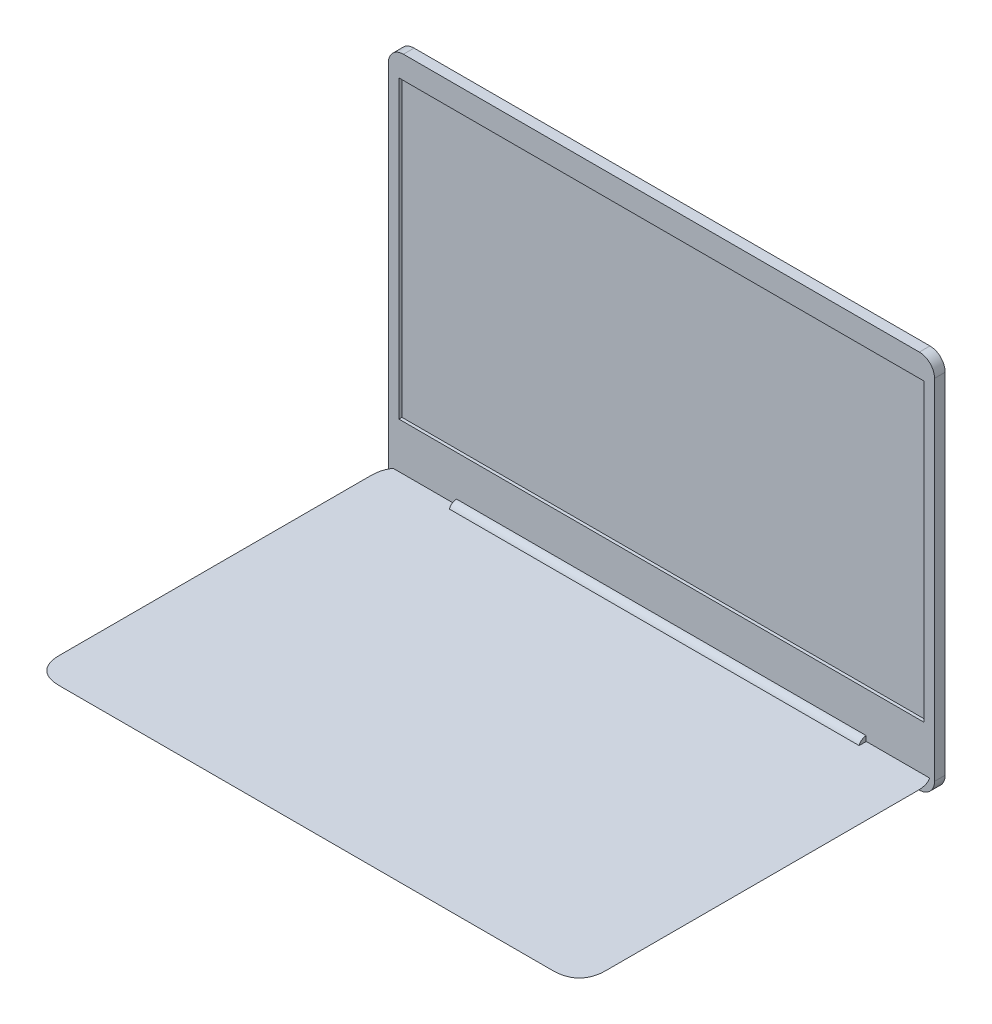
ISO-10303-21;
HEADER;
FILE_DESCRIPTION(('STEP AP214'),'2;1');
FILE_NAME('part.step','',(''),(''),'','','');
FILE_SCHEMA(('AUTOMOTIVE_DESIGN { 1 0 10303 214 1 1 1 1 }'));
ENDSEC;
DATA;
#1=APPLICATION_CONTEXT('core data for automotive mechanical design processes');
#2=APPLICATION_PROTOCOL_DEFINITION('international standard','automotive_design',2000,#1);
#3=PRODUCT_CONTEXT('',#1,'mechanical');
#4=PRODUCT('Part','Part','',(#3));
#5=PRODUCT_RELATED_PRODUCT_CATEGORY('part','',(#4));
#6=PRODUCT_DEFINITION_FORMATION('','',#4);
#7=PRODUCT_DEFINITION_CONTEXT('part definition',#1,'design');
#8=PRODUCT_DEFINITION('design','',#6,#7);
#9=PRODUCT_DEFINITION_SHAPE('','',#8);
#10=(LENGTH_UNIT() NAMED_UNIT(*) SI_UNIT(.MILLI.,.METRE.));
#11=(NAMED_UNIT(*) PLANE_ANGLE_UNIT() SI_UNIT($,.RADIAN.));
#12=(NAMED_UNIT(*) SI_UNIT($,.STERADIAN.) SOLID_ANGLE_UNIT());
#13=UNCERTAINTY_MEASURE_WITH_UNIT(LENGTH_MEASURE(1.E-05),#10,'distance_accuracy_value','');
#14=(GEOMETRIC_REPRESENTATION_CONTEXT(3) GLOBAL_UNCERTAINTY_ASSIGNED_CONTEXT((#13)) GLOBAL_UNIT_ASSIGNED_CONTEXT((#10,
#11,#12)) REPRESENTATION_CONTEXT('',''));
#15=CARTESIAN_POINT('',(0.,0.,0.));
#16=DIRECTION('',(0.,0.,1.));
#17=DIRECTION('',(1.,0.,0.));
#18=AXIS2_PLACEMENT_3D('',#15,#16,#17);
#19=CARTESIAN_POINT('',(-135.,-13.,-110.));
#20=DIRECTION('',(-1.,0.,0.));
#21=DIRECTION('',(0.,0.,1.));
#22=AXIS2_PLACEMENT_3D('',#19,#20,#21);
#23=PLANE('',#22);
#24=DIRECTION('',(0.,0.499999999999998,-0.86602540378444));
#25=VECTOR('',#24,1.);
#26=CARTESIAN_POINT('',(-135.,0.,-120.));
#27=LINE('',#26,#25);
#28=CARTESIAN_POINT('',(-135.,-5.36835751112594,-110.701732037536));
#29=VERTEX_POINT('',#28);
#30=CARTESIAN_POINT('',(-135.,-3.43004034719931,-114.05899584664));
#31=VERTEX_POINT('',#30);
#32=EDGE_CURVE('E349',#29,#31,#27,.T.);
#33=ORIENTED_EDGE('',*,*,#32,.T.);
#34=DIRECTION('',(0.,1.,0.));
#35=VECTOR('',#34,1.);
#36=CARTESIAN_POINT('',(-135.,-13.,-114.05899584664));
#37=LINE('',#36,#35);
#38=CARTESIAN_POINT('',(-135.,-1.66312071490332,-114.05899584664));
#39=VERTEX_POINT('',#38);
#40=EDGE_CURVE('E298',#31,#39,#37,.T.);
#41=ORIENTED_EDGE('',*,*,#40,.T.);
#42=DIRECTION('',(0.,0.741047359244526,-0.671452761820751));
#43=VECTOR('',#42,1.);
#44=CARTESIAN_POINT('',(-135.,-1.66312071490332,-114.05899584664));
#45=LINE('',#44,#43);
#46=EDGE_CURVE('E317',#29,#39,#45,.T.);
#47=ORIENTED_EDGE('',*,*,#46,.F.);
#48=EDGE_LOOP('',(#33,#41,#47));
#49=FACE_BOUND('',#48,.T.);
#50=ADVANCED_FACE('F38',(#49),#23,.F.);
#51=CARTESIAN_POINT('',(135.,-13.,-110.));
#52=DIRECTION('',(1.,0.,0.));
#53=DIRECTION('',(0.,0.,-1.));
#54=AXIS2_PLACEMENT_3D('',#51,#52,#53);
#55=PLANE('',#54);
#56=DIRECTION('',(0.,0.741047359244526,-0.671452761820751));
#57=VECTOR('',#56,1.);
#58=CARTESIAN_POINT('',(135.,-1.66312071490332,-114.05899584664));
#59=LINE('',#58,#57);
#60=CARTESIAN_POINT('',(135.,-5.36835751112596,-110.701732037536));
#61=VERTEX_POINT('',#60);
#62=CARTESIAN_POINT('',(135.,-1.66312071490332,-114.05899584664));
#63=VERTEX_POINT('',#62);
#64=EDGE_CURVE('E322',#61,#63,#59,.T.);
#65=ORIENTED_EDGE('',*,*,#64,.T.);
#66=DIRECTION('',(0.,-1.,0.));
#67=VECTOR('',#66,1.);
#68=CARTESIAN_POINT('',(135.,-13.,-114.05899584664));
#69=LINE('',#68,#67);
#70=CARTESIAN_POINT('',(135.,-3.43004034719933,-114.05899584664));
#71=VERTEX_POINT('',#70);
#72=EDGE_CURVE('E284',#63,#71,#69,.T.);
#73=ORIENTED_EDGE('',*,*,#72,.T.);
#74=DIRECTION('',(0.,-0.499999999999998,0.86602540378444));
#75=VECTOR('',#74,1.);
#76=CARTESIAN_POINT('',(135.,0.,-120.));
#77=LINE('',#76,#75);
#78=EDGE_CURVE('E347',#71,#61,#77,.T.);
#79=ORIENTED_EDGE('',*,*,#78,.T.);
#80=EDGE_LOOP('',(#65,#73,#79));
#81=FACE_BOUND('',#80,.T.);
#82=ADVANCED_FACE('F511',(#81),#55,.F.);
#83=CARTESIAN_POINT('',(135.,-13.,-110.));
#84=DIRECTION('',(0.,0.,1.));
#85=DIRECTION('',(1.,0.,0.));
#86=AXIS2_PLACEMENT_3D('',#83,#84,#85);
#87=PLANE('',#86);
#88=DIRECTION('',(-1.,0.,0.));
#89=VECTOR('',#88,1.);
#90=CARTESIAN_POINT('',(145.038981406413,-4.58280438218018,-110.));
#91=LINE('',#90,#89);
#92=CARTESIAN_POINT('',(135.,-4.58280438218018,-110.));
#93=VERTEX_POINT('',#92);
#94=CARTESIAN_POINT('',(-135.,-4.58280438218014,-110.));
#95=VERTEX_POINT('',#94);
#96=EDGE_CURVE('E369',#93,#95,#91,.T.);
#97=ORIENTED_EDGE('',*,*,#96,.F.);
#98=DIRECTION('',(0.,1.,0.));
#99=VECTOR('',#98,1.);
#100=CARTESIAN_POINT('',(135.,-13.,-110.));
#101=LINE('',#100,#99);
#102=CARTESIAN_POINT('',(135.,-5.77350269189621,-110.));
#103=VERTEX_POINT('',#102);
#104=EDGE_CURVE('E340',#103,#93,#101,.T.);
#105=ORIENTED_EDGE('',*,*,#104,.F.);
#106=DIRECTION('',(-1.,0.,0.));
#107=VECTOR('',#106,1.);
#108=CARTESIAN_POINT('',(165.,-5.77350269189621,-110.));
#109=LINE('',#108,#107);
#110=CARTESIAN_POINT('',(-135.,-5.77350269189621,-110.));
#111=VERTEX_POINT('',#110);
#112=EDGE_CURVE('E343',#103,#111,#109,.T.);
#113=ORIENTED_EDGE('',*,*,#112,.T.);
#114=DIRECTION('',(0.,1.,0.));
#115=VECTOR('',#114,1.);
#116=CARTESIAN_POINT('',(-135.,-13.,-110.));
#117=LINE('',#116,#115);
#118=EDGE_CURVE('E339',#111,#95,#117,.T.);
#119=ORIENTED_EDGE('',*,*,#118,.T.);
#120=EDGE_LOOP('',(#97,#105,#113,#119));
#121=FACE_BOUND('',#120,.T.);
#122=ADVANCED_FACE('F518',(#121),#87,.F.);
#123=CARTESIAN_POINT('',(-180.,0.,105.));
#124=DIRECTION('',(-0.499999999999998,-0.86602540378444,0.));
#125=DIRECTION('',(0.86602540378444,-0.499999999999998,0.));
#126=AXIS2_PLACEMENT_3D('',#123,#124,#125);
#127=PLANE('',#126);
#128=DIRECTION('',(0.,0.,1.));
#129=VECTOR('',#128,1.);
#130=CARTESIAN_POINT('',(-157.483339501605,-13.,105.));
#131=LINE('',#130,#129);
#132=CARTESIAN_POINT('',(-157.483339501605,-13.,-79.9833395016045));
#133=VERTEX_POINT('',#132);
#134=CARTESIAN_POINT('',(-157.483339501605,-13.,79.9833395016046));
#135=VERTEX_POINT('',#134);
#136=EDGE_CURVE('E366',#133,#135,#131,.T.);
#137=ORIENTED_EDGE('',*,*,#136,.T.);
#138=DIRECTION('',(-0.654653670707978,0.377964473009225,0.654653670707978));
#139=VECTOR('',#138,1.);
#140=CARTESIAN_POINT('',(-181.071428571429,0.618589574131692,103.571428571429));
#141=LINE('',#140,#139);
#142=CARTESIAN_POINT('',(-180.,0.,102.5));
#143=VERTEX_POINT('',#142);
#144=EDGE_CURVE('E415',#135,#143,#141,.T.);
#145=ORIENTED_EDGE('',*,*,#144,.T.);
#146=DIRECTION('',(0.,0.,1.));
#147=VECTOR('',#146,1.);
#148=CARTESIAN_POINT('',(-180.,0.,105.));
#149=LINE('',#148,#147);
#150=CARTESIAN_POINT('',(-180.,0.,-102.5));
#151=VERTEX_POINT('',#150);
#152=EDGE_CURVE('E359',#151,#143,#149,.T.);
#153=ORIENTED_EDGE('',*,*,#152,.F.);
#154=DIRECTION('',(-0.654653670707978,0.377964473009225,-0.654653670707978));
#155=VECTOR('',#154,1.);
#156=CARTESIAN_POINT('',(-91.0714285714285,-51.3429346529344,-13.5714285714285));
#157=LINE('',#156,#155);
#158=EDGE_CURVE('E413',#151,#133,#157,.F.);
#159=ORIENTED_EDGE('',*,*,#158,.T.);
#160=EDGE_LOOP('',(#137,#145,#153,#159));
#161=FACE_BOUND('',#160,.T.);
#162=ADVANCED_FACE('F462',(#161),#127,.T.);
#163=CARTESIAN_POINT('',(165.,0.,-120.));
#164=DIRECTION('',(0.,-0.86602540378444,-0.499999999999998));
#165=DIRECTION('',(0.,0.499999999999998,-0.86602540378444));
#166=AXIS2_PLACEMENT_3D('',#163,#164,#165);
#167=PLANE('',#166);
#168=DIRECTION('',(-1.,0.,0.));
#169=VECTOR('',#168,1.);
#170=CARTESIAN_POINT('',(165.,-13.,-97.4833395016045));
#171=LINE('',#170,#169);
#172=CARTESIAN_POINT('',(139.983339501604,-13.,-97.4833395016045));
#173=VERTEX_POINT('',#172);
#174=CARTESIAN_POINT('',(-139.983339501605,-13.,-97.4833395016044));
#175=VERTEX_POINT('',#174);
#176=EDGE_CURVE('E370',#173,#175,#171,.T.);
#177=ORIENTED_EDGE('',*,*,#176,.T.);
#178=DIRECTION('',(-0.654653670707978,0.377964473009226,-0.654653670707978));
#179=VECTOR('',#178,1.);
#180=CARTESIAN_POINT('',(-22.1428571428571,-81.0352342112579,20.3571428571431));
#181=LINE('',#180,#179);
#182=CARTESIAN_POINT('',(-156.55899584664,-3.43004034719931,-114.05899584664));
#183=VERTEX_POINT('',#182);
#184=EDGE_CURVE('E441',#175,#183,#181,.T.);
#185=ORIENTED_EDGE('',*,*,#184,.T.);
#186=DIRECTION('',(-1.,0.,0.));
#187=VECTOR('',#186,1.);
#188=CARTESIAN_POINT('',(165.,-3.43004034719934,-114.05899584664));
#189=LINE('',#188,#187);
#190=EDGE_CURVE('E302',#31,#183,#189,.T.);
#191=ORIENTED_EDGE('',*,*,#190,.F.);
#192=ORIENTED_EDGE('',*,*,#32,.F.);
#193=EDGE_CURVE('E350',#111,#29,#27,.T.);
#194=ORIENTED_EDGE('',*,*,#193,.F.);
#195=ORIENTED_EDGE('',*,*,#112,.F.);
#196=EDGE_CURVE('E346',#61,#103,#77,.T.);
#197=ORIENTED_EDGE('',*,*,#196,.F.);
#198=ORIENTED_EDGE('',*,*,#78,.F.);
#199=CARTESIAN_POINT('',(156.55899584664,-3.43004034719934,-114.05899584664));
#200=VERTEX_POINT('',#199);
#201=EDGE_CURVE('E297',#200,#71,#189,.T.);
#202=ORIENTED_EDGE('',*,*,#201,.F.);
#203=DIRECTION('',(0.654653670707978,0.377964473009225,-0.654653670707978));
#204=VECTOR('',#203,1.);
#205=CARTESIAN_POINT('',(163.571428571428,0.618589574131695,-121.071428571429));
#206=LINE('',#205,#204);
#207=EDGE_CURVE('E439',#200,#173,#206,.F.);
#208=ORIENTED_EDGE('',*,*,#207,.T.);
#209=EDGE_LOOP('',(#177,#185,#191,#192,#194,#195,#197,#198,#202,#208));
#210=FACE_BOUND('',#209,.T.);
#211=ADVANCED_FACE('F547',(#210),#167,.T.);
#212=CARTESIAN_POINT('',(180.,0.,105.));
#213=DIRECTION('',(0.499999999999998,-0.86602540378444,0.));
#214=DIRECTION('',(0.86602540378444,0.499999999999998,0.));
#215=AXIS2_PLACEMENT_3D('',#212,#213,#214);
#216=PLANE('',#215);
#217=DIRECTION('',(0.,0.,-1.));
#218=VECTOR('',#217,1.);
#219=CARTESIAN_POINT('',(157.483339501604,-13.,105.));
#220=LINE('',#219,#218);
#221=CARTESIAN_POINT('',(157.483339501604,-13.,79.9833395016045));
#222=VERTEX_POINT('',#221);
#223=CARTESIAN_POINT('',(157.483339501604,-13.,-79.9833395016045));
#224=VERTEX_POINT('',#223);
#225=EDGE_CURVE('E365',#222,#224,#220,.T.);
#226=ORIENTED_EDGE('',*,*,#225,.T.);
#227=DIRECTION('',(0.654653670707978,0.377964473009225,-0.654653670707978));
#228=VECTOR('',#227,1.);
#229=CARTESIAN_POINT('',(91.0714285714284,-51.3429346529344,-13.5714285714286));
#230=LINE('',#229,#228);
#231=CARTESIAN_POINT('',(180.,0.,-102.5));
#232=VERTEX_POINT('',#231);
#233=EDGE_CURVE('E445',#224,#232,#230,.T.);
#234=ORIENTED_EDGE('',*,*,#233,.T.);
#235=DIRECTION('',(0.,0.,-1.));
#236=VECTOR('',#235,1.);
#237=CARTESIAN_POINT('',(180.,0.,105.));
#238=LINE('',#237,#236);
#239=CARTESIAN_POINT('',(180.,0.,102.5));
#240=VERTEX_POINT('',#239);
#241=EDGE_CURVE('E356',#240,#232,#238,.T.);
#242=ORIENTED_EDGE('',*,*,#241,.F.);
#243=DIRECTION('',(0.654653670707978,0.377964473009225,0.654653670707978));
#244=VECTOR('',#243,1.);
#245=CARTESIAN_POINT('',(181.071428571428,0.618589574131696,103.571428571429));
#246=LINE('',#245,#244);
#247=EDGE_CURVE('E443',#240,#222,#246,.F.);
#248=ORIENTED_EDGE('',*,*,#247,.T.);
#249=EDGE_LOOP('',(#226,#234,#242,#248));
#250=FACE_BOUND('',#249,.T.);
#251=ADVANCED_FACE('F481',(#250),#216,.T.);
#252=CARTESIAN_POINT('',(165.,0.,120.));
#253=DIRECTION('',(0.,-0.86602540378444,0.499999999999998));
#254=DIRECTION('',(0.,-0.499999999999998,-0.86602540378444));
#255=AXIS2_PLACEMENT_3D('',#252,#253,#254);
#256=PLANE('',#255);
#257=DIRECTION('',(1.,0.,0.));
#258=VECTOR('',#257,1.);
#259=CARTESIAN_POINT('',(165.,0.,120.));
#260=LINE('',#259,#258);
#261=CARTESIAN_POINT('',(-162.5,0.,120.));
#262=VERTEX_POINT('',#261);
#263=CARTESIAN_POINT('',(162.5,0.,120.));
#264=VERTEX_POINT('',#263);
#265=EDGE_CURVE('E353',#262,#264,#260,.T.);
#266=ORIENTED_EDGE('',*,*,#265,.F.);
#267=DIRECTION('',(-0.654653670707978,0.377964473009225,0.654653670707978));
#268=VECTOR('',#267,1.);
#269=CARTESIAN_POINT('',(-22.142857142857,-81.0352342112579,-20.3571428571431));
#270=LINE('',#269,#268);
#271=CARTESIAN_POINT('',(-139.983339501605,-13.,97.4833395016045));
#272=VERTEX_POINT('',#271);
#273=EDGE_CURVE('E429',#262,#272,#270,.F.);
#274=ORIENTED_EDGE('',*,*,#273,.T.);
#275=DIRECTION('',(1.,0.,0.));
#276=VECTOR('',#275,1.);
#277=CARTESIAN_POINT('',(165.,-13.,97.4833395016044));
#278=LINE('',#277,#276);
#279=CARTESIAN_POINT('',(139.983339501604,-13.,97.4833395016044));
#280=VERTEX_POINT('',#279);
#281=EDGE_CURVE('E362',#272,#280,#278,.T.);
#282=ORIENTED_EDGE('',*,*,#281,.T.);
#283=DIRECTION('',(0.654653670707978,0.377964473009226,0.654653670707978));
#284=VECTOR('',#283,1.);
#285=CARTESIAN_POINT('',(163.571428571428,0.618589574131699,121.071428571428));
#286=LINE('',#285,#284);
#287=EDGE_CURVE('E426',#280,#264,#286,.T.);
#288=ORIENTED_EDGE('',*,*,#287,.T.);
#289=EDGE_LOOP('',(#266,#274,#282,#288));
#290=FACE_BOUND('',#289,.T.);
#291=ADVANCED_FACE('F474',(#290),#256,.T.);
#292=CARTESIAN_POINT('',(-165.,-13.,105.));
#293=DIRECTION('',(0.,-1.,0.));
#294=DIRECTION('',(0.,0.,-1.));
#295=AXIS2_PLACEMENT_3D('',#292,#293,#294);
#296=PLANE('',#295);
#297=ORIENTED_EDGE('',*,*,#281,.F.);
#298=CARTESIAN_POINT('',(-87.4833395016042,-13.,27.4833395016042));
#299=DIRECTION('',(0.,-1.,0.));
#300=DIRECTION('',(-0.707106781186548,0.,0.707106781186548));
#301=AXIS2_PLACEMENT_3D('',#298,#299,#300);
#302=ELLIPSE('',#301,92.6012958872611,35.);
#303=EDGE_CURVE('E437',#272,#135,#302,.T.);
#304=ORIENTED_EDGE('',*,*,#303,.T.);
#305=ORIENTED_EDGE('',*,*,#136,.F.);
#306=CARTESIAN_POINT('',(-87.4833395016042,-13.,-27.4833395016041));
#307=DIRECTION('',(0.,-1.,0.));
#308=DIRECTION('',(-0.707106781186548,0.,-0.707106781186548));
#309=AXIS2_PLACEMENT_3D('',#306,#307,#308);
#310=ELLIPSE('',#309,92.6012958872611,35.);
#311=EDGE_CURVE('E435',#133,#175,#310,.T.);
#312=ORIENTED_EDGE('',*,*,#311,.T.);
#313=ORIENTED_EDGE('',*,*,#176,.F.);
#314=CARTESIAN_POINT('',(87.4833395016041,-13.,-27.4833395016042));
#315=DIRECTION('',(0.,-1.,0.));
#316=DIRECTION('',(0.707106781186548,0.,-0.707106781186548));
#317=AXIS2_PLACEMENT_3D('',#314,#315,#316);
#318=ELLIPSE('',#317,92.6012958872611,35.);
#319=EDGE_CURVE('E433',#173,#224,#318,.T.);
#320=ORIENTED_EDGE('',*,*,#319,.T.);
#321=ORIENTED_EDGE('',*,*,#225,.F.);
#322=CARTESIAN_POINT('',(87.4833395016041,-13.,27.4833395016042));
#323=DIRECTION('',(0.,-1.,0.));
#324=DIRECTION('',(0.707106781186548,0.,0.707106781186548));
#325=AXIS2_PLACEMENT_3D('',#322,#323,#324);
#326=ELLIPSE('',#325,92.6012958872611,35.);
#327=EDGE_CURVE('E431',#222,#280,#326,.T.);
#328=ORIENTED_EDGE('',*,*,#327,.T.);
#329=EDGE_LOOP('',(#297,#304,#305,#312,#313,#320,#321,#328));
#330=FACE_BOUND('',#329,.T.);
#331=ADVANCED_FACE('F466',(#330),#296,.T.);
#332=CARTESIAN_POINT('',(-165.,0.,105.));
#333=DIRECTION('',(0.,-1.,0.));
#334=DIRECTION('',(0.,0.,-1.));
#335=AXIS2_PLACEMENT_3D('',#332,#333,#334);
#336=PLANE('',#335);
#337=ORIENTED_EDGE('',*,*,#152,.T.);
#338=CARTESIAN_POINT('',(-110.,0.,49.9999999999997));
#339=DIRECTION('',(0.,-1.,0.));
#340=DIRECTION('',(-0.707106781186548,0.,0.707106781186548));
#341=AXIS2_PLACEMENT_3D('',#338,#339,#340);
#342=ELLIPSE('',#341,92.6012958872611,35.);
#343=EDGE_CURVE('E424',#143,#262,#342,.F.);
#344=ORIENTED_EDGE('',*,*,#343,.T.);
#345=ORIENTED_EDGE('',*,*,#265,.T.);
#346=CARTESIAN_POINT('',(110.,0.,49.9999999999997));
#347=DIRECTION('',(0.,-1.,0.));
#348=DIRECTION('',(0.707106781186548,0.,0.707106781186548));
#349=AXIS2_PLACEMENT_3D('',#346,#347,#348);
#350=ELLIPSE('',#349,92.6012958872611,35.);
#351=EDGE_CURVE('E418',#264,#240,#350,.F.);
#352=ORIENTED_EDGE('',*,*,#351,.T.);
#353=ORIENTED_EDGE('',*,*,#241,.T.);
#354=CARTESIAN_POINT('',(110.,0.,-49.9999999999997));
#355=DIRECTION('',(0.,-1.,0.));
#356=DIRECTION('',(0.707106781186548,0.,-0.707106781186548));
#357=AXIS2_PLACEMENT_3D('',#354,#355,#356);
#358=ELLIPSE('',#357,92.6012958872611,35.);
#359=CARTESIAN_POINT('',(176.710920661126,0.,-114.05899584664));
#360=VERTEX_POINT('',#359);
#361=EDGE_CURVE('E420',#232,#360,#358,.F.);
#362=ORIENTED_EDGE('',*,*,#361,.T.);
#363=DIRECTION('',(-1.,0.,0.));
#364=VECTOR('',#363,1.);
#365=CARTESIAN_POINT('',(-165.,0.,-114.05899584664));
#366=LINE('',#365,#364);
#367=CARTESIAN_POINT('',(135.,0.,-114.05899584664));
#368=VERTEX_POINT('',#367);
#369=EDGE_CURVE('E304',#360,#368,#366,.T.);
#370=ORIENTED_EDGE('',*,*,#369,.T.);
#371=DIRECTION('',(0.,0.,-1.));
#372=VECTOR('',#371,1.);
#373=CARTESIAN_POINT('',(135.,0.,-110.));
#374=LINE('',#373,#372);
#375=CARTESIAN_POINT('',(135.,0.,-109.343698455418));
#376=VERTEX_POINT('',#375);
#377=EDGE_CURVE('E336',#376,#368,#374,.T.);
#378=ORIENTED_EDGE('',*,*,#377,.F.);
#379=DIRECTION('',(-1.,0.,0.));
#380=VECTOR('',#379,1.);
#381=CARTESIAN_POINT('',(145.038981406413,0.,-109.343698455418));
#382=LINE('',#381,#380);
#383=CARTESIAN_POINT('',(-135.,0.,-109.343698455418));
#384=VERTEX_POINT('',#383);
#385=EDGE_CURVE('E333',#384,#376,#382,.F.);
#386=ORIENTED_EDGE('',*,*,#385,.F.);
#387=DIRECTION('',(0.,0.,-1.));
#388=VECTOR('',#387,1.);
#389=CARTESIAN_POINT('',(-135.,0.,105.));
#390=LINE('',#389,#388);
#391=CARTESIAN_POINT('',(-135.,0.,-114.05899584664));
#392=VERTEX_POINT('',#391);
#393=EDGE_CURVE('E321',#384,#392,#390,.T.);
#394=ORIENTED_EDGE('',*,*,#393,.T.);
#395=CARTESIAN_POINT('',(-176.710920661127,0.,-114.05899584664));
#396=VERTEX_POINT('',#395);
#397=EDGE_CURVE('E306',#392,#396,#366,.T.);
#398=ORIENTED_EDGE('',*,*,#397,.T.);
#399=CARTESIAN_POINT('',(-110.,0.,-49.9999999999997));
#400=DIRECTION('',(0.,-1.,0.));
#401=DIRECTION('',(-0.707106781186548,0.,-0.707106781186548));
#402=AXIS2_PLACEMENT_3D('',#399,#400,#401);
#403=ELLIPSE('',#402,92.6012958872611,35.);
#404=EDGE_CURVE('E422',#396,#151,#403,.F.);
#405=ORIENTED_EDGE('',*,*,#404,.T.);
#406=EDGE_LOOP('',(#337,#344,#345,#352,#353,#362,#370,#378,#386,#394,#398,#405));
#407=FACE_BOUND('',#406,.T.);
#408=ADVANCED_FACE('F453',(#407),#336,.F.);
#409=CARTESIAN_POINT('',(-135.,-1.66312071490332,-114.05899584664));
#410=DIRECTION('',(1.,0.,0.));
#411=DIRECTION('',(0.,0.,1.));
#412=AXIS2_PLACEMENT_3D('',#409,#410,#411);
#413=CIRCLE('',#412,5.);
#414=EDGE_CURVE('E311',#95,#29,#413,.T.);
#415=ORIENTED_EDGE('',*,*,#414,.F.);
#416=ORIENTED_EDGE('',*,*,#118,.F.);
#417=ORIENTED_EDGE('',*,*,#193,.T.);
#418=EDGE_LOOP('',(#415,#416,#417));
#419=FACE_BOUND('',#418,.T.);
#420=ADVANCED_FACE('F514',(#419),#23,.F.);
#421=CARTESIAN_POINT('',(135.,-1.66312071490332,-114.05899584664));
#422=DIRECTION('',(1.,0.,0.));
#423=DIRECTION('',(0.,0.,-1.));
#424=AXIS2_PLACEMENT_3D('',#421,#422,#423);
#425=CIRCLE('',#424,5.);
#426=EDGE_CURVE('E310',#93,#61,#425,.T.);
#427=ORIENTED_EDGE('',*,*,#426,.T.);
#428=ORIENTED_EDGE('',*,*,#196,.T.);
#429=ORIENTED_EDGE('',*,*,#104,.T.);
#430=EDGE_LOOP('',(#427,#428,#429));
#431=FACE_BOUND('',#430,.T.);
#432=ADVANCED_FACE('F521',(#431),#55,.F.);
#433=CARTESIAN_POINT('',(145.038981406413,-1.66312071490332,-114.05899584664));
#434=DIRECTION('',(-1.,0.,0.));
#435=DIRECTION('',(0.,0.,1.));
#436=AXIS2_PLACEMENT_3D('',#433,#434,#435);
#437=CYLINDRICAL_SURFACE('',#436,5.);
#438=CARTESIAN_POINT('',(-135.,3.33687928509668,-114.05899584664));
#439=VERTEX_POINT('',#438);
#440=EDGE_CURVE('E307',#439,#384,#413,.T.);
#441=ORIENTED_EDGE('',*,*,#440,.T.);
#442=ORIENTED_EDGE('',*,*,#385,.T.);
#443=CARTESIAN_POINT('',(135.,3.33687928509668,-114.05899584664));
#444=VERTEX_POINT('',#443);
#445=EDGE_CURVE('E324',#444,#376,#425,.T.);
#446=ORIENTED_EDGE('',*,*,#445,.F.);
#447=DIRECTION('',(-1.,0.,0.));
#448=VECTOR('',#447,1.);
#449=CARTESIAN_POINT('',(145.038981406413,3.33687928509668,-114.05899584664));
#450=LINE('',#449,#448);
#451=EDGE_CURVE('E315',#444,#439,#450,.T.);
#452=ORIENTED_EDGE('',*,*,#451,.T.);
#453=EDGE_LOOP('',(#441,#442,#446,#452));
#454=FACE_BOUND('',#453,.T.);
#455=ADVANCED_FACE('F494',(#454),#437,.T.);
#456=ORIENTED_EDGE('',*,*,#426,.F.);
#457=ORIENTED_EDGE('',*,*,#96,.T.);
#458=ORIENTED_EDGE('',*,*,#414,.T.);
#459=DIRECTION('',(-1.,0.,0.));
#460=VECTOR('',#459,1.);
#461=CARTESIAN_POINT('',(145.038981406413,-5.36835751112595,-110.701732037536));
#462=LINE('',#461,#460);
#463=EDGE_CURVE('E301',#61,#29,#462,.T.);
#464=ORIENTED_EDGE('',*,*,#463,.F.);
#465=EDGE_LOOP('',(#456,#457,#458,#464));
#466=FACE_BOUND('',#465,.T.);
#467=ADVANCED_FACE('F499',(#466),#437,.T.);
#468=CARTESIAN_POINT('',(-135.,-1.66312071490332,-114.05899584664));
#469=DIRECTION('',(-1.,0.,0.));
#470=DIRECTION('',(0.,0.,1.));
#471=AXIS2_PLACEMENT_3D('',#468,#469,#470);
#472=PLANE('',#471);
#473=ORIENTED_EDGE('',*,*,#393,.F.);
#474=ORIENTED_EDGE('',*,*,#440,.F.);
#475=DIRECTION('',(0.,1.,0.));
#476=VECTOR('',#475,1.);
#477=CARTESIAN_POINT('',(-135.,3.33687928509668,-114.05899584664));
#478=LINE('',#477,#476);
#479=EDGE_CURVE('E312',#392,#439,#478,.T.);
#480=ORIENTED_EDGE('',*,*,#479,.F.);
#481=EDGE_LOOP('',(#473,#474,#480));
#482=FACE_BOUND('',#481,.T.);
#483=ADVANCED_FACE('F497',(#482),#472,.T.);
#484=CARTESIAN_POINT('',(135.,-13.,-110.));
#485=DIRECTION('',(1.,0.,0.));
#486=DIRECTION('',(0.,0.,-1.));
#487=AXIS2_PLACEMENT_3D('',#484,#485,#486);
#488=PLANE('',#487);
#489=ORIENTED_EDGE('',*,*,#377,.T.);
#490=DIRECTION('',(0.,1.,0.));
#491=VECTOR('',#490,1.);
#492=CARTESIAN_POINT('',(135.,3.33687928509668,-114.05899584664));
#493=LINE('',#492,#491);
#494=EDGE_CURVE('E319',#368,#444,#493,.T.);
#495=ORIENTED_EDGE('',*,*,#494,.T.);
#496=ORIENTED_EDGE('',*,*,#445,.T.);
#497=EDGE_LOOP('',(#489,#495,#496));
#498=FACE_BOUND('',#497,.T.);
#499=ADVANCED_FACE('F492',(#498),#488,.T.);
#500=CARTESIAN_POINT('',(145.038981406413,-1.66312071490332,-114.05899584664));
#501=DIRECTION('',(0.,0.671452761820751,0.741047359244526));
#502=DIRECTION('',(0.,-0.741047359244526,0.671452761820752));
#503=AXIS2_PLACEMENT_3D('',#500,#501,#502);
#504=PLANE('',#503);
#505=ORIENTED_EDGE('',*,*,#64,.F.);
#506=ORIENTED_EDGE('',*,*,#463,.T.);
#507=ORIENTED_EDGE('',*,*,#46,.T.);
#508=DIRECTION('',(-1.,0.,0.));
#509=VECTOR('',#508,1.);
#510=CARTESIAN_POINT('',(145.038981406413,-1.66312071490332,-114.05899584664));
#511=LINE('',#510,#509);
#512=EDGE_CURVE('E316',#63,#39,#511,.T.);
#513=ORIENTED_EDGE('',*,*,#512,.F.);
#514=EDGE_LOOP('',(#505,#506,#507,#513));
#515=FACE_BOUND('',#514,.T.);
#516=ADVANCED_FACE('F505',(#515),#504,.F.);
#517=CARTESIAN_POINT('',(0.,0.,-114.05899584664));
#518=DIRECTION('',(0.,0.,1.));
#519=DIRECTION('',(1.,0.,0.));
#520=AXIS2_PLACEMENT_3D('',#517,#518,#519);
#521=PLANE('',#520);
#522=DIRECTION('',(0.,-1.,0.));
#523=VECTOR('',#522,1.);
#524=CARTESIAN_POINT('',(-173.,30.,-114.05899584664));
#525=LINE('',#524,#523);
#526=CARTESIAN_POINT('',(-173.,224.737035936842,-114.05899584664));
#527=VERTEX_POINT('',#526);
#528=CARTESIAN_POINT('',(-173.,30.,-114.05899584664));
#529=VERTEX_POINT('',#528);
#530=EDGE_CURVE('E235',#527,#529,#525,.T.);
#531=ORIENTED_EDGE('',*,*,#530,.F.);
#532=DIRECTION('',(-1.,0.,0.));
#533=VECTOR('',#532,1.);
#534=CARTESIAN_POINT('',(173.,224.737035936842,-114.05899584664));
#535=LINE('',#534,#533);
#536=CARTESIAN_POINT('',(173.,224.737035936842,-114.05899584664));
#537=VERTEX_POINT('',#536);
#538=EDGE_CURVE('E252',#537,#527,#535,.T.);
#539=ORIENTED_EDGE('',*,*,#538,.F.);
#540=DIRECTION('',(0.,1.,0.));
#541=VECTOR('',#540,1.);
#542=CARTESIAN_POINT('',(173.,30.,-114.05899584664));
#543=LINE('',#542,#541);
#544=CARTESIAN_POINT('',(173.,30.,-114.05899584664));
#545=VERTEX_POINT('',#544);
#546=EDGE_CURVE('E255',#545,#537,#543,.T.);
#547=ORIENTED_EDGE('',*,*,#546,.F.);
#548=DIRECTION('',(1.,0.,0.));
#549=VECTOR('',#548,1.);
#550=CARTESIAN_POINT('',(173.,30.,-114.05899584664));
#551=LINE('',#550,#549);
#552=EDGE_CURVE('E261',#529,#545,#551,.T.);
#553=ORIENTED_EDGE('',*,*,#552,.F.);
#554=EDGE_LOOP('',(#531,#539,#547,#553));
#555=FACE_BOUND('',#554,.T.);
#556=DIRECTION('',(0.,1.,0.));
#557=VECTOR('',#556,1.);
#558=CARTESIAN_POINT('',(-180.,239.737035936842,-114.05899584664));
#559=LINE('',#558,#557);
#560=CARTESIAN_POINT('',(-180.,-0.262964063157595,-114.05899584664));
#561=VERTEX_POINT('',#560);
#562=CARTESIAN_POINT('',(-180.,229.737035936842,-114.05899584664));
#563=VERTEX_POINT('',#562);
#564=EDGE_CURVE('E290',#561,#563,#559,.T.);
#565=ORIENTED_EDGE('',*,*,#564,.F.);
#566=CARTESIAN_POINT('',(-170.,-0.262964063157595,-114.05899584664));
#567=DIRECTION('',(0.,0.,1.));
#568=DIRECTION('',(1.,0.,0.));
#569=AXIS2_PLACEMENT_3D('',#566,#567,#568);
#570=CIRCLE('',#569,10.);
#571=CARTESIAN_POINT('',(-170.,-10.2629640631576,-114.05899584664));
#572=VERTEX_POINT('',#571);
#573=EDGE_CURVE('E388',#561,#572,#570,.T.);
#574=ORIENTED_EDGE('',*,*,#573,.T.);
#575=DIRECTION('',(-1.,0.,0.));
#576=VECTOR('',#575,1.);
#577=CARTESIAN_POINT('',(-180.,-10.2629640631576,-114.05899584664));
#578=LINE('',#577,#576);
#579=CARTESIAN_POINT('',(170.,-10.2629640631576,-114.05899584664));
#580=VERTEX_POINT('',#579);
#581=EDGE_CURVE('E287',#580,#572,#578,.T.);
#582=ORIENTED_EDGE('',*,*,#581,.F.);
#583=CARTESIAN_POINT('',(170.,-0.262964063157635,-114.05899584664));
#584=DIRECTION('',(0.,0.,1.));
#585=DIRECTION('',(1.,0.,0.));
#586=AXIS2_PLACEMENT_3D('',#583,#584,#585);
#587=CIRCLE('',#586,10.);
#588=CARTESIAN_POINT('',(180.,-0.26296406315765,-114.05899584664));
#589=VERTEX_POINT('',#588);
#590=EDGE_CURVE('E386',#580,#589,#587,.T.);
#591=ORIENTED_EDGE('',*,*,#590,.T.);
#592=DIRECTION('',(0.,-1.,0.));
#593=VECTOR('',#592,1.);
#594=CARTESIAN_POINT('',(180.,239.737035936842,-114.05899584664));
#595=LINE('',#594,#593);
#596=CARTESIAN_POINT('',(180.,229.737035936842,-114.05899584664));
#597=VERTEX_POINT('',#596);
#598=EDGE_CURVE('E267',#597,#589,#595,.T.);
#599=ORIENTED_EDGE('',*,*,#598,.F.);
#600=CARTESIAN_POINT('',(170.,229.737035936842,-114.05899584664));
#601=DIRECTION('',(0.,0.,1.));
#602=DIRECTION('',(1.,0.,0.));
#603=AXIS2_PLACEMENT_3D('',#600,#601,#602);
#604=CIRCLE('',#603,10.);
#605=CARTESIAN_POINT('',(170.,239.737035936842,-114.05899584664));
#606=VERTEX_POINT('',#605);
#607=EDGE_CURVE('E384',#597,#606,#604,.T.);
#608=ORIENTED_EDGE('',*,*,#607,.T.);
#609=DIRECTION('',(1.,0.,0.));
#610=VECTOR('',#609,1.);
#611=CARTESIAN_POINT('',(-180.,239.737035936842,-114.05899584664));
#612=LINE('',#611,#610);
#613=CARTESIAN_POINT('',(-170.,239.737035936842,-114.05899584664));
#614=VERTEX_POINT('',#613);
#615=EDGE_CURVE('E275',#614,#606,#612,.T.);
#616=ORIENTED_EDGE('',*,*,#615,.F.);
#617=CARTESIAN_POINT('',(-170.,229.737035936842,-114.05899584664));
#618=DIRECTION('',(0.,0.,1.));
#619=DIRECTION('',(1.,0.,0.));
#620=AXIS2_PLACEMENT_3D('',#617,#618,#619);
#621=CIRCLE('',#620,10.);
#622=EDGE_CURVE('E382',#614,#563,#621,.T.);
#623=ORIENTED_EDGE('',*,*,#622,.T.);
#624=EDGE_LOOP('',(#565,#574,#582,#591,#599,#608,#616,#623));
#625=FACE_BOUND('',#624,.T.);
#626=ORIENTED_EDGE('',*,*,#40,.F.);
#627=ORIENTED_EDGE('',*,*,#190,.T.);
#628=CARTESIAN_POINT('',(-174.05899584664,36.9844784960744,-114.05899584664));
#629=DIRECTION('',(0.,0.,1.));
#630=DIRECTION('',(-0.86602540378444,0.499999999999998,0.));
#631=AXIS2_PLACEMENT_3D('',#628,#629,#630);
#632=ELLIPSE('',#631,53.4633831078181,35.);
#633=EDGE_CURVE('E46',#183,#396,#632,.F.);
#634=ORIENTED_EDGE('',*,*,#633,.T.);
#635=ORIENTED_EDGE('',*,*,#397,.F.);
#636=ORIENTED_EDGE('',*,*,#479,.T.);
#637=ORIENTED_EDGE('',*,*,#451,.F.);
#638=ORIENTED_EDGE('',*,*,#494,.F.);
#639=ORIENTED_EDGE('',*,*,#369,.F.);
#640=CARTESIAN_POINT('',(174.058995846639,36.9844784960744,-114.05899584664));
#641=DIRECTION('',(0.,0.,1.));
#642=DIRECTION('',(0.86602540378444,0.499999999999998,0.));
#643=AXIS2_PLACEMENT_3D('',#640,#641,#642);
#644=ELLIPSE('',#643,53.4633831078181,35.);
#645=EDGE_CURVE('E11',#360,#200,#644,.F.);
#646=ORIENTED_EDGE('',*,*,#645,.T.);
#647=ORIENTED_EDGE('',*,*,#201,.T.);
#648=ORIENTED_EDGE('',*,*,#72,.F.);
#649=ORIENTED_EDGE('',*,*,#512,.T.);
#650=EDGE_LOOP('',(#626,#627,#634,#635,#636,#637,#638,#639,#646,#647,#648,#649));
#651=FACE_BOUND('',#650,.T.);
#652=ADVANCED_FACE('F451',(#555,#625,#651),#521,.T.);
#653=CARTESIAN_POINT('',(180.,239.737035936842,-121.05899584664));
#654=DIRECTION('',(-1.,0.,0.));
#655=DIRECTION('',(0.,-1.,0.));
#656=AXIS2_PLACEMENT_3D('',#653,#654,#655);
#657=PLANE('',#656);
#658=ORIENTED_EDGE('',*,*,#598,.T.);
#659=DIRECTION('',(0.,0.,1.));
#660=VECTOR('',#659,1.);
#661=CARTESIAN_POINT('',(180.,-0.26296406315765,-121.05899584664));
#662=LINE('',#661,#660);
#663=CARTESIAN_POINT('',(180.,-0.26296406315765,-121.05899584664));
#664=VERTEX_POINT('',#663);
#665=EDGE_CURVE('E406',#589,#664,#662,.F.);
#666=ORIENTED_EDGE('',*,*,#665,.T.);
#667=DIRECTION('',(0.,-1.,0.));
#668=VECTOR('',#667,1.);
#669=CARTESIAN_POINT('',(180.,239.737035936842,-121.05899584664));
#670=LINE('',#669,#668);
#671=CARTESIAN_POINT('',(180.,229.737035936842,-121.05899584664));
#672=VERTEX_POINT('',#671);
#673=EDGE_CURVE('E271',#672,#664,#670,.T.);
#674=ORIENTED_EDGE('',*,*,#673,.F.);
#675=DIRECTION('',(0.,0.,1.));
#676=VECTOR('',#675,1.);
#677=CARTESIAN_POINT('',(180.,229.737035936842,-121.05899584664));
#678=LINE('',#677,#676);
#679=EDGE_CURVE('E403',#672,#597,#678,.T.);
#680=ORIENTED_EDGE('',*,*,#679,.T.);
#681=EDGE_LOOP('',(#658,#666,#674,#680));
#682=FACE_BOUND('',#681,.T.);
#683=ADVANCED_FACE('F559',(#682),#657,.F.);
#684=CARTESIAN_POINT('',(-180.,-10.2629640631576,-121.05899584664));
#685=DIRECTION('',(0.,1.,0.));
#686=DIRECTION('',(-1.,0.,0.));
#687=AXIS2_PLACEMENT_3D('',#684,#685,#686);
#688=PLANE('',#687);
#689=ORIENTED_EDGE('',*,*,#581,.T.);
#690=DIRECTION('',(0.,0.,1.));
#691=VECTOR('',#690,1.);
#692=CARTESIAN_POINT('',(-170.,-10.2629640631576,-121.05899584664));
#693=LINE('',#692,#691);
#694=CARTESIAN_POINT('',(-170.,-10.2629640631576,-121.05899584664));
#695=VERTEX_POINT('',#694);
#696=EDGE_CURVE('E393',#572,#695,#693,.F.);
#697=ORIENTED_EDGE('',*,*,#696,.T.);
#698=DIRECTION('',(-1.,0.,0.));
#699=VECTOR('',#698,1.);
#700=CARTESIAN_POINT('',(-180.,-10.2629640631576,-121.05899584664));
#701=LINE('',#700,#699);
#702=CARTESIAN_POINT('',(170.,-10.2629640631576,-121.05899584664));
#703=VERTEX_POINT('',#702);
#704=EDGE_CURVE('E274',#703,#695,#701,.T.);
#705=ORIENTED_EDGE('',*,*,#704,.F.);
#706=DIRECTION('',(0.,0.,1.));
#707=VECTOR('',#706,1.);
#708=CARTESIAN_POINT('',(170.,-10.2629640631576,-121.05899584664));
#709=LINE('',#708,#707);
#710=EDGE_CURVE('E390',#703,#580,#709,.T.);
#711=ORIENTED_EDGE('',*,*,#710,.T.);
#712=EDGE_LOOP('',(#689,#697,#705,#711));
#713=FACE_BOUND('',#712,.T.);
#714=ADVANCED_FACE('F722',(#713),#688,.F.);
#715=CARTESIAN_POINT('',(-180.,239.737035936842,-121.05899584664));
#716=DIRECTION('',(1.,0.,0.));
#717=DIRECTION('',(0.,0.,-1.));
#718=AXIS2_PLACEMENT_3D('',#715,#716,#717);
#719=PLANE('',#718);
#720=DIRECTION('',(0.,1.,0.));
#721=VECTOR('',#720,1.);
#722=CARTESIAN_POINT('',(-180.,239.737035936842,-121.05899584664));
#723=LINE('',#722,#721);
#724=CARTESIAN_POINT('',(-180.,-0.262964063157595,-121.05899584664));
#725=VERTEX_POINT('',#724);
#726=CARTESIAN_POINT('',(-180.,229.737035936842,-121.05899584664));
#727=VERTEX_POINT('',#726);
#728=EDGE_CURVE('E278',#725,#727,#723,.T.);
#729=ORIENTED_EDGE('',*,*,#728,.F.);
#730=DIRECTION('',(0.,0.,1.));
#731=VECTOR('',#730,1.);
#732=CARTESIAN_POINT('',(-180.,-0.262964063157595,-121.05899584664));
#733=LINE('',#732,#731);
#734=EDGE_CURVE('E379',#725,#561,#733,.T.);
#735=ORIENTED_EDGE('',*,*,#734,.T.);
#736=ORIENTED_EDGE('',*,*,#564,.T.);
#737=DIRECTION('',(0.,0.,1.));
#738=VECTOR('',#737,1.);
#739=CARTESIAN_POINT('',(-180.,229.737035936842,-121.05899584664));
#740=LINE('',#739,#738);
#741=EDGE_CURVE('E377',#563,#727,#740,.F.);
#742=ORIENTED_EDGE('',*,*,#741,.T.);
#743=EDGE_LOOP('',(#729,#735,#736,#742));
#744=FACE_BOUND('',#743,.T.);
#745=ADVANCED_FACE('F730',(#744),#719,.F.);
#746=CARTESIAN_POINT('',(-180.,239.737035936842,-121.05899584664));
#747=DIRECTION('',(0.,-1.,0.));
#748=DIRECTION('',(1.,0.,0.));
#749=AXIS2_PLACEMENT_3D('',#746,#747,#748);
#750=PLANE('',#749);
#751=ORIENTED_EDGE('',*,*,#615,.T.);
#752=DIRECTION('',(0.,0.,1.));
#753=VECTOR('',#752,1.);
#754=CARTESIAN_POINT('',(170.,239.737035936842,-121.05899584664));
#755=LINE('',#754,#753);
#756=CARTESIAN_POINT('',(170.,239.737035936842,-121.05899584664));
#757=VERTEX_POINT('',#756);
#758=EDGE_CURVE('E411',#606,#757,#755,.F.);
#759=ORIENTED_EDGE('',*,*,#758,.T.);
#760=DIRECTION('',(1.,0.,0.));
#761=VECTOR('',#760,1.);
#762=CARTESIAN_POINT('',(-180.,239.737035936842,-121.05899584664));
#763=LINE('',#762,#761);
#764=CARTESIAN_POINT('',(-170.,239.737035936842,-121.05899584664));
#765=VERTEX_POINT('',#764);
#766=EDGE_CURVE('E281',#765,#757,#763,.T.);
#767=ORIENTED_EDGE('',*,*,#766,.F.);
#768=DIRECTION('',(0.,0.,1.));
#769=VECTOR('',#768,1.);
#770=CARTESIAN_POINT('',(-170.,239.737035936842,-121.05899584664));
#771=LINE('',#770,#769);
#772=EDGE_CURVE('E408',#765,#614,#771,.T.);
#773=ORIENTED_EDGE('',*,*,#772,.T.);
#774=EDGE_LOOP('',(#751,#759,#767,#773));
#775=FACE_BOUND('',#774,.T.);
#776=ADVANCED_FACE('F739',(#775),#750,.F.);
#777=CARTESIAN_POINT('',(0.,0.,-121.05899584664));
#778=DIRECTION('',(0.,0.,1.));
#779=DIRECTION('',(1.,0.,0.));
#780=AXIS2_PLACEMENT_3D('',#777,#778,#779);
#781=PLANE('',#780);
#782=ORIENTED_EDGE('',*,*,#704,.T.);
#783=CARTESIAN_POINT('',(-170.,-0.262964063157595,-121.05899584664));
#784=DIRECTION('',(0.,0.,1.));
#785=DIRECTION('',(1.,0.,0.));
#786=AXIS2_PLACEMENT_3D('',#783,#784,#785);
#787=CIRCLE('',#786,10.);
#788=EDGE_CURVE('E401',#695,#725,#787,.F.);
#789=ORIENTED_EDGE('',*,*,#788,.T.);
#790=ORIENTED_EDGE('',*,*,#728,.T.);
#791=CARTESIAN_POINT('',(-170.,229.737035936842,-121.05899584664));
#792=DIRECTION('',(0.,0.,1.));
#793=DIRECTION('',(1.,0.,0.));
#794=AXIS2_PLACEMENT_3D('',#791,#792,#793);
#795=CIRCLE('',#794,10.);
#796=EDGE_CURVE('E395',#727,#765,#795,.F.);
#797=ORIENTED_EDGE('',*,*,#796,.T.);
#798=ORIENTED_EDGE('',*,*,#766,.T.);
#799=CARTESIAN_POINT('',(170.,229.737035936842,-121.05899584664));
#800=DIRECTION('',(0.,0.,1.));
#801=DIRECTION('',(1.,0.,0.));
#802=AXIS2_PLACEMENT_3D('',#799,#800,#801);
#803=CIRCLE('',#802,10.);
#804=EDGE_CURVE('E397',#757,#672,#803,.F.);
#805=ORIENTED_EDGE('',*,*,#804,.T.);
#806=ORIENTED_EDGE('',*,*,#673,.T.);
#807=CARTESIAN_POINT('',(170.,-0.262964063157635,-121.05899584664));
#808=DIRECTION('',(0.,0.,1.));
#809=DIRECTION('',(1.,0.,0.));
#810=AXIS2_PLACEMENT_3D('',#807,#808,#809);
#811=CIRCLE('',#810,10.);
#812=EDGE_CURVE('E399',#664,#703,#811,.F.);
#813=ORIENTED_EDGE('',*,*,#812,.T.);
#814=EDGE_LOOP('',(#782,#789,#790,#797,#798,#805,#806,#813));
#815=FACE_BOUND('',#814,.T.);
#816=ADVANCED_FACE('F578',(#815),#781,.F.);
#817=CARTESIAN_POINT('',(-170.,-0.262964063157595,-121.05899584664));
#818=DIRECTION('',(0.,0.,1.));
#819=DIRECTION('',(1.,0.,0.));
#820=AXIS2_PLACEMENT_3D('',#817,#818,#819);
#821=CYLINDRICAL_SURFACE('',#820,10.);
#822=ORIENTED_EDGE('',*,*,#788,.F.);
#823=ORIENTED_EDGE('',*,*,#696,.F.);
#824=ORIENTED_EDGE('',*,*,#573,.F.);
#825=ORIENTED_EDGE('',*,*,#734,.F.);
#826=EDGE_LOOP('',(#822,#823,#824,#825));
#827=FACE_BOUND('',#826,.T.);
#828=ADVANCED_FACE('F574',(#827),#821,.T.);
#829=CARTESIAN_POINT('',(170.,-0.262964063157635,-121.05899584664));
#830=DIRECTION('',(0.,0.,1.));
#831=DIRECTION('',(1.,0.,0.));
#832=AXIS2_PLACEMENT_3D('',#829,#830,#831);
#833=CYLINDRICAL_SURFACE('',#832,10.);
#834=ORIENTED_EDGE('',*,*,#812,.F.);
#835=ORIENTED_EDGE('',*,*,#665,.F.);
#836=ORIENTED_EDGE('',*,*,#590,.F.);
#837=ORIENTED_EDGE('',*,*,#710,.F.);
#838=EDGE_LOOP('',(#834,#835,#836,#837));
#839=FACE_BOUND('',#838,.T.);
#840=ADVANCED_FACE('F577',(#839),#833,.T.);
#841=CARTESIAN_POINT('',(170.,229.737035936842,-121.05899584664));
#842=DIRECTION('',(0.,0.,1.));
#843=DIRECTION('',(1.,0.,0.));
#844=AXIS2_PLACEMENT_3D('',#841,#842,#843);
#845=CYLINDRICAL_SURFACE('',#844,10.);
#846=ORIENTED_EDGE('',*,*,#804,.F.);
#847=ORIENTED_EDGE('',*,*,#758,.F.);
#848=ORIENTED_EDGE('',*,*,#607,.F.);
#849=ORIENTED_EDGE('',*,*,#679,.F.);
#850=EDGE_LOOP('',(#846,#847,#848,#849));
#851=FACE_BOUND('',#850,.T.);
#852=ADVANCED_FACE('F582',(#851),#845,.T.);
#853=CARTESIAN_POINT('',(-170.,229.737035936842,-121.05899584664));
#854=DIRECTION('',(0.,0.,1.));
#855=DIRECTION('',(1.,0.,0.));
#856=AXIS2_PLACEMENT_3D('',#853,#854,#855);
#857=CYLINDRICAL_SURFACE('',#856,10.);
#858=ORIENTED_EDGE('',*,*,#796,.F.);
#859=ORIENTED_EDGE('',*,*,#741,.F.);
#860=ORIENTED_EDGE('',*,*,#622,.F.);
#861=ORIENTED_EDGE('',*,*,#772,.F.);
#862=EDGE_LOOP('',(#858,#859,#860,#861));
#863=FACE_BOUND('',#862,.T.);
#864=ADVANCED_FACE('F586',(#863),#857,.T.);
#865=CARTESIAN_POINT('',(-173.,30.,-116.05899584664));
#866=DIRECTION('',(-1.,0.,0.));
#867=DIRECTION('',(0.,0.,1.));
#868=AXIS2_PLACEMENT_3D('',#865,#866,#867);
#869=PLANE('',#868);
#870=ORIENTED_EDGE('',*,*,#530,.T.);
#871=DIRECTION('',(0.,0.,1.));
#872=VECTOR('',#871,1.);
#873=CARTESIAN_POINT('',(-173.,30.,-116.05899584664));
#874=LINE('',#873,#872);
#875=CARTESIAN_POINT('',(-173.,30.,-116.05899584664));
#876=VERTEX_POINT('',#875);
#877=EDGE_CURVE('E228',#876,#529,#874,.T.);
#878=ORIENTED_EDGE('',*,*,#877,.F.);
#879=DIRECTION('',(0.,-1.,0.));
#880=VECTOR('',#879,1.);
#881=CARTESIAN_POINT('',(-173.,30.,-116.05899584664));
#882=LINE('',#881,#880);
#883=CARTESIAN_POINT('',(-173.,224.737035936842,-116.05899584664));
#884=VERTEX_POINT('',#883);
#885=EDGE_CURVE('E232',#884,#876,#882,.T.);
#886=ORIENTED_EDGE('',*,*,#885,.F.);
#887=DIRECTION('',(0.,0.,1.));
#888=VECTOR('',#887,1.);
#889=CARTESIAN_POINT('',(-173.,224.737035936842,-116.05899584664));
#890=LINE('',#889,#888);
#891=EDGE_CURVE('E265',#884,#527,#890,.T.);
#892=ORIENTED_EDGE('',*,*,#891,.T.);
#893=EDGE_LOOP('',(#870,#878,#886,#892));
#894=FACE_BOUND('',#893,.T.);
#895=ADVANCED_FACE('F230',(#894),#869,.F.);
#896=CARTESIAN_POINT('',(173.,224.737035936842,-116.05899584664));
#897=DIRECTION('',(0.,1.,0.));
#898=DIRECTION('',(0.,0.,1.));
#899=AXIS2_PLACEMENT_3D('',#896,#897,#898);
#900=PLANE('',#899);
#901=ORIENTED_EDGE('',*,*,#538,.T.);
#902=ORIENTED_EDGE('',*,*,#891,.F.);
#903=DIRECTION('',(-1.,0.,0.));
#904=VECTOR('',#903,1.);
#905=CARTESIAN_POINT('',(173.,224.737035936842,-116.05899584664));
#906=LINE('',#905,#904);
#907=CARTESIAN_POINT('',(173.,224.737035936842,-116.05899584664));
#908=VERTEX_POINT('',#907);
#909=EDGE_CURVE('E240',#908,#884,#906,.T.);
#910=ORIENTED_EDGE('',*,*,#909,.F.);
#911=DIRECTION('',(0.,0.,1.));
#912=VECTOR('',#911,1.);
#913=CARTESIAN_POINT('',(173.,224.737035936842,-116.05899584664));
#914=LINE('',#913,#912);
#915=EDGE_CURVE('E268',#908,#537,#914,.T.);
#916=ORIENTED_EDGE('',*,*,#915,.T.);
#917=EDGE_LOOP('',(#901,#902,#910,#916));
#918=FACE_BOUND('',#917,.T.);
#919=ADVANCED_FACE('F784',(#918),#900,.F.);
#920=CARTESIAN_POINT('',(173.,30.,-116.05899584664));
#921=DIRECTION('',(1.,0.,0.));
#922=DIRECTION('',(0.,1.,0.));
#923=AXIS2_PLACEMENT_3D('',#920,#921,#922);
#924=PLANE('',#923);
#925=ORIENTED_EDGE('',*,*,#546,.T.);
#926=ORIENTED_EDGE('',*,*,#915,.F.);
#927=DIRECTION('',(0.,1.,0.));
#928=VECTOR('',#927,1.);
#929=CARTESIAN_POINT('',(173.,30.,-116.05899584664));
#930=LINE('',#929,#928);
#931=CARTESIAN_POINT('',(173.,30.,-116.05899584664));
#932=VERTEX_POINT('',#931);
#933=EDGE_CURVE('E248',#932,#908,#930,.T.);
#934=ORIENTED_EDGE('',*,*,#933,.F.);
#935=DIRECTION('',(0.,0.,1.));
#936=VECTOR('',#935,1.);
#937=CARTESIAN_POINT('',(173.,30.,-116.05899584664));
#938=LINE('',#937,#936);
#939=EDGE_CURVE('E239',#932,#545,#938,.T.);
#940=ORIENTED_EDGE('',*,*,#939,.T.);
#941=EDGE_LOOP('',(#925,#926,#934,#940));
#942=FACE_BOUND('',#941,.T.);
#943=ADVANCED_FACE('F792',(#942),#924,.F.);
#944=CARTESIAN_POINT('',(173.,30.,-116.05899584664));
#945=DIRECTION('',(0.,-1.,0.));
#946=DIRECTION('',(0.,0.,-1.));
#947=AXIS2_PLACEMENT_3D('',#944,#945,#946);
#948=PLANE('',#947);
#949=ORIENTED_EDGE('',*,*,#552,.T.);
#950=ORIENTED_EDGE('',*,*,#939,.F.);
#951=DIRECTION('',(1.,0.,0.));
#952=VECTOR('',#951,1.);
#953=CARTESIAN_POINT('',(173.,30.,-116.05899584664));
#954=LINE('',#953,#952);
#955=EDGE_CURVE('E243',#876,#932,#954,.T.);
#956=ORIENTED_EDGE('',*,*,#955,.F.);
#957=ORIENTED_EDGE('',*,*,#877,.T.);
#958=EDGE_LOOP('',(#949,#950,#956,#957));
#959=FACE_BOUND('',#958,.T.);
#960=ADVANCED_FACE('F244',(#959),#948,.F.);
#961=CARTESIAN_POINT('',(0.,0.,-116.05899584664));
#962=DIRECTION('',(0.,0.,1.));
#963=DIRECTION('',(1.,0.,0.));
#964=AXIS2_PLACEMENT_3D('',#961,#962,#963);
#965=PLANE('',#964);
#966=ORIENTED_EDGE('',*,*,#885,.T.);
#967=ORIENTED_EDGE('',*,*,#955,.T.);
#968=ORIENTED_EDGE('',*,*,#933,.T.);
#969=ORIENTED_EDGE('',*,*,#909,.T.);
#970=EDGE_LOOP('',(#966,#967,#968,#969));
#971=FACE_BOUND('',#970,.T.);
#972=ADVANCED_FACE('F250',(#971),#965,.T.);
#973=CARTESIAN_POINT('',(-163.571428571429,30.9294787065871,103.571428571429));
#974=DIRECTION('',(-0.654653670707978,0.377964473009225,0.654653670707978));
#975=DIRECTION('',(0.707106781186548,0.,0.707106781186548));
#976=AXIS2_PLACEMENT_3D('',#973,#974,#975);
#977=CYLINDRICAL_SURFACE('',#976,35.);
#978=ORIENTED_EDGE('',*,*,#303,.F.);
#979=ORIENTED_EDGE('',*,*,#273,.F.);
#980=ORIENTED_EDGE('',*,*,#343,.F.);
#981=ORIENTED_EDGE('',*,*,#144,.F.);
#982=EDGE_LOOP('',(#978,#979,#980,#981));
#983=FACE_BOUND('',#982,.T.);
#984=ADVANCED_FACE('F471',(#983),#977,.T.);
#985=CARTESIAN_POINT('',(-22.1428571428571,-50.7243450788025,37.857142857143));
#986=DIRECTION('',(-0.654653670707978,0.377964473009226,-0.654653670707978));
#987=DIRECTION('',(-0.707106781186548,0.,0.707106781186548));
#988=AXIS2_PLACEMENT_3D('',#985,#986,#987);
#989=CYLINDRICAL_SURFACE('',#988,35.);
#990=ORIENTED_EDGE('',*,*,#311,.F.);
#991=ORIENTED_EDGE('',*,*,#158,.F.);
#992=ORIENTED_EDGE('',*,*,#404,.F.);
#993=ORIENTED_EDGE('',*,*,#633,.F.);
#994=ORIENTED_EDGE('',*,*,#184,.F.);
#995=EDGE_LOOP('',(#990,#991,#992,#993,#994));
#996=FACE_BOUND('',#995,.T.);
#997=ADVANCED_FACE('F459',(#996),#989,.T.);
#998=CARTESIAN_POINT('',(73.5714285714285,-21.032045520479,-13.5714285714285));
#999=DIRECTION('',(0.654653670707978,0.377964473009225,-0.654653670707978));
#1000=DIRECTION('',(-0.707106781186548,0.,-0.707106781186548));
#1001=AXIS2_PLACEMENT_3D('',#998,#999,#1000);
#1002=CYLINDRICAL_SURFACE('',#1001,35.);
#1003=ORIENTED_EDGE('',*,*,#319,.F.);
#1004=ORIENTED_EDGE('',*,*,#207,.F.);
#1005=ORIENTED_EDGE('',*,*,#645,.F.);
#1006=ORIENTED_EDGE('',*,*,#361,.F.);
#1007=ORIENTED_EDGE('',*,*,#233,.F.);
#1008=EDGE_LOOP('',(#1003,#1004,#1005,#1006,#1007));
#1009=FACE_BOUND('',#1008,.T.);
#1010=ADVANCED_FACE('F486',(#1009),#1002,.T.);
#1011=CARTESIAN_POINT('',(163.571428571428,30.9294787065871,103.571428571429));
#1012=DIRECTION('',(0.654653670707978,0.377964473009226,0.654653670707978));
#1013=DIRECTION('',(0.707106781186548,0.,-0.707106781186548));
#1014=AXIS2_PLACEMENT_3D('',#1011,#1012,#1013);
#1015=CYLINDRICAL_SURFACE('',#1014,35.);
#1016=ORIENTED_EDGE('',*,*,#327,.F.);
#1017=ORIENTED_EDGE('',*,*,#247,.F.);
#1018=ORIENTED_EDGE('',*,*,#351,.F.);
#1019=ORIENTED_EDGE('',*,*,#287,.F.);
#1020=EDGE_LOOP('',(#1016,#1017,#1018,#1019));
#1021=FACE_BOUND('',#1020,.T.);
#1022=ADVANCED_FACE('F40',(#1021),#1015,.T.);
#1023=CLOSED_SHELL('',(#50,#82,#122,#162,#211,#251,#291,#331,#408,#420,#432,#455,#467,#483,#499,
#516,#652,#683,#714,#745,#776,#816,#828,#840,#852,#864,#895,#919,#943,#960,#972,#984,#997,#1010,#1022));
#1024=MANIFOLD_SOLID_BREP('B2',#1023);
#1025=ADVANCED_BREP_SHAPE_REPRESENTATION('',(#18,#1024),#14);
#1026=SHAPE_DEFINITION_REPRESENTATION(#9,#1025);
ENDSEC;
END-ISO-10303-21;
